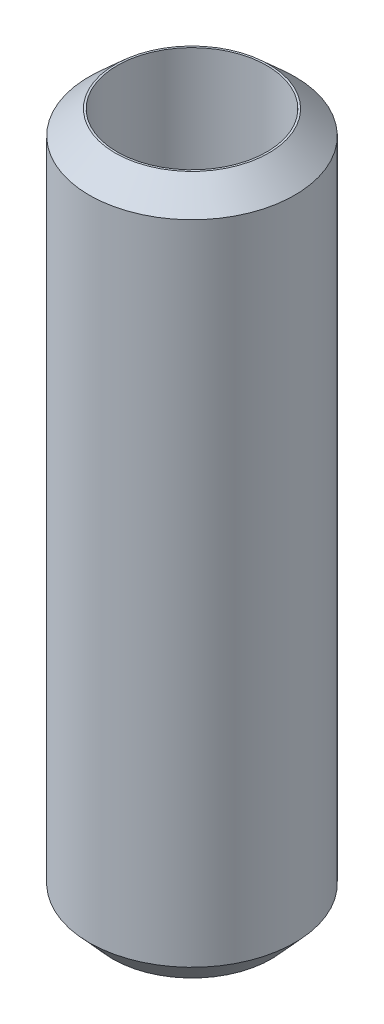
ISO-10303-21;
HEADER;
FILE_DESCRIPTION(('STEP AP214'),'2;1');
FILE_NAME('part.step','',(''),(''),'','','');
FILE_SCHEMA(('AUTOMOTIVE_DESIGN { 1 0 10303 214 1 1 1 1 }'));
ENDSEC;
DATA;
#1=APPLICATION_CONTEXT('core data for automotive mechanical design processes');
#2=APPLICATION_PROTOCOL_DEFINITION('international standard','automotive_design',2000,#1);
#3=PRODUCT_CONTEXT('',#1,'mechanical');
#4=PRODUCT('Part','Part','',(#3));
#5=PRODUCT_RELATED_PRODUCT_CATEGORY('part','',(#4));
#6=PRODUCT_DEFINITION_FORMATION('','',#4);
#7=PRODUCT_DEFINITION_CONTEXT('part definition',#1,'design');
#8=PRODUCT_DEFINITION('design','',#6,#7);
#9=PRODUCT_DEFINITION_SHAPE('','',#8);
#10=(LENGTH_UNIT() NAMED_UNIT(*) SI_UNIT(.MILLI.,.METRE.));
#11=(NAMED_UNIT(*) PLANE_ANGLE_UNIT() SI_UNIT($,.RADIAN.));
#12=(NAMED_UNIT(*) SI_UNIT($,.STERADIAN.) SOLID_ANGLE_UNIT());
#13=UNCERTAINTY_MEASURE_WITH_UNIT(LENGTH_MEASURE(1.E-05),#10,'distance_accuracy_value','');
#14=(GEOMETRIC_REPRESENTATION_CONTEXT(3) GLOBAL_UNCERTAINTY_ASSIGNED_CONTEXT((#13)) GLOBAL_UNIT_ASSIGNED_CONTEXT((#10,
#11,#12)) REPRESENTATION_CONTEXT('',''));
#15=CARTESIAN_POINT('',(0.,0.,0.));
#16=DIRECTION('',(0.,0.,1.));
#17=DIRECTION('',(1.,0.,0.));
#18=AXIS2_PLACEMENT_3D('',#15,#16,#17);
#19=CARTESIAN_POINT('',(0.,169.547093007213,0.));
#20=DIRECTION('',(0.,-1.,0.));
#21=DIRECTION('',(0.,0.,-1.));
#22=AXIS2_PLACEMENT_3D('',#19,#20,#21);
#23=CYLINDRICAL_SURFACE('',#22,25.);
#24=CARTESIAN_POINT('',(0.,163.824932687635,0.));
#25=DIRECTION('',(0.,1.,0.));
#26=DIRECTION('',(0.,0.,1.));
#27=AXIS2_PLACEMENT_3D('',#24,#25,#26);
#28=CIRCLE('',#27,25.);
#29=CARTESIAN_POINT('',(0.,163.824932687635,25.));
#30=VERTEX_POINT('',#29);
#31=EDGE_CURVE('E50',#30,#30,#28,.F.);
#32=ORIENTED_EDGE('',*,*,#31,.T.);
#33=EDGE_LOOP('',(#32));
#34=FACE_BOUND('',#33,.T.);
#35=CARTESIAN_POINT('',(0.,6.31015189124612,0.));
#36=DIRECTION('',(0.,1.,0.));
#37=DIRECTION('',(0.,0.,1.));
#38=AXIS2_PLACEMENT_3D('',#35,#36,#37);
#39=CIRCLE('',#38,25.);
#40=CARTESIAN_POINT('',(0.,6.31015189124612,25.));
#41=VERTEX_POINT('',#40);
#42=EDGE_CURVE('E51',#41,#41,#39,.T.);
#43=ORIENTED_EDGE('',*,*,#42,.T.);
#44=EDGE_LOOP('',(#43));
#45=FACE_BOUND('',#44,.T.);
#46=ADVANCED_FACE('F39',(#34,#45),#23,.T.);
#47=CARTESIAN_POINT('',(0.,169.547093007213,0.));
#48=DIRECTION('',(0.,1.,0.));
#49=DIRECTION('',(0.,0.,1.));
#50=AXIS2_PLACEMENT_3D('',#47,#48,#49);
#51=PLANE('',#50);
#52=CARTESIAN_POINT('',(0.,169.547093007213,0.));
#53=DIRECTION('',(0.,1.,0.));
#54=DIRECTION('',(0.,0.,1.));
#55=AXIS2_PLACEMENT_3D('',#52,#53,#54);
#56=CIRCLE('',#55,18.6898481087538);
#57=CARTESIAN_POINT('',(0.,169.547093007213,18.6898481087538));
#58=VERTEX_POINT('',#57);
#59=EDGE_CURVE('E54',#58,#58,#56,.T.);
#60=ORIENTED_EDGE('',*,*,#59,.T.);
#61=EDGE_LOOP('',(#60));
#62=FACE_BOUND('',#61,.T.);
#63=CARTESIAN_POINT('',(0.,169.547093007213,0.));
#64=DIRECTION('',(0.,1.,0.));
#65=DIRECTION('',(0.,0.,1.));
#66=AXIS2_PLACEMENT_3D('',#63,#64,#65);
#67=CIRCLE('',#66,18.2172366982053);
#68=CARTESIAN_POINT('',(0.,169.547093007213,18.2172366982053));
#69=VERTEX_POINT('',#68);
#70=EDGE_CURVE('E58',#69,#69,#67,.T.);
#71=ORIENTED_EDGE('',*,*,#70,.F.);
#72=EDGE_LOOP('',(#71));
#73=FACE_BOUND('',#72,.T.);
#74=ADVANCED_FACE('F69',(#62,#73),#51,.T.);
#75=CARTESIAN_POINT('',(0.,0.,0.));
#76=DIRECTION('',(0.,1.,0.));
#77=DIRECTION('',(0.,0.,1.));
#78=AXIS2_PLACEMENT_3D('',#75,#76,#77);
#79=PLANE('',#78);
#80=CARTESIAN_POINT('',(0.,0.,0.));
#81=DIRECTION('',(0.,1.,0.));
#82=DIRECTION('',(0.,0.,1.));
#83=AXIS2_PLACEMENT_3D('',#80,#81,#82);
#84=CIRCLE('',#83,19.2778396804223);
#85=CARTESIAN_POINT('',(0.,0.,19.2778396804223));
#86=VERTEX_POINT('',#85);
#87=EDGE_CURVE('E10',#86,#86,#84,.F.);
#88=ORIENTED_EDGE('',*,*,#87,.T.);
#89=EDGE_LOOP('',(#88));
#90=FACE_BOUND('',#89,.T.);
#91=CARTESIAN_POINT('',(0.,0.,0.));
#92=DIRECTION('',(0.,1.,0.));
#93=DIRECTION('',(0.,0.,1.));
#94=AXIS2_PLACEMENT_3D('',#91,#92,#93);
#95=CIRCLE('',#94,18.2172366982053);
#96=CARTESIAN_POINT('',(0.,0.,18.2172366982053));
#97=VERTEX_POINT('',#96);
#98=EDGE_CURVE('E63',#97,#97,#95,.T.);
#99=ORIENTED_EDGE('',*,*,#98,.T.);
#100=EDGE_LOOP('',(#99));
#101=FACE_BOUND('',#100,.T.);
#102=ADVANCED_FACE('F75',(#90,#101),#79,.F.);
#103=CARTESIAN_POINT('',(0.,169.547093007213,0.));
#104=DIRECTION('',(0.,-1.,0.));
#105=DIRECTION('',(0.,0.,-1.));
#106=AXIS2_PLACEMENT_3D('',#103,#104,#105);
#107=CYLINDRICAL_SURFACE('',#106,18.2172366982053);
#108=ORIENTED_EDGE('',*,*,#70,.T.);
#109=EDGE_LOOP('',(#108));
#110=FACE_BOUND('',#109,.T.);
#111=ORIENTED_EDGE('',*,*,#98,.F.);
#112=EDGE_LOOP('',(#111));
#113=FACE_BOUND('',#112,.T.);
#114=ADVANCED_FACE('F70',(#110,#113),#107,.F.);
#115=CARTESIAN_POINT('',(0.,169.547093007213,0.));
#116=DIRECTION('',(0.,-1.,0.));
#117=DIRECTION('',(0.,0.,-1.));
#118=AXIS2_PLACEMENT_3D('',#115,#116,#117);
#119=CONICAL_SURFACE('',#118,18.6898481087538,0.834227031792203);
#120=ORIENTED_EDGE('',*,*,#31,.F.);
#121=EDGE_LOOP('',(#120));
#122=FACE_BOUND('',#121,.T.);
#123=ORIENTED_EDGE('',*,*,#59,.F.);
#124=EDGE_LOOP('',(#123));
#125=FACE_BOUND('',#124,.T.);
#126=ADVANCED_FACE('F81',(#122,#125),#119,.T.);
#127=CARTESIAN_POINT('',(0.,6.31015189124612,0.));
#128=DIRECTION('',(0.,1.,0.));
#129=DIRECTION('',(0.,0.,1.));
#130=AXIS2_PLACEMENT_3D('',#127,#128,#129);
#131=CONICAL_SURFACE('',#130,25.,0.736569295002693);
#132=ORIENTED_EDGE('',*,*,#87,.F.);
#133=EDGE_LOOP('',(#132));
#134=FACE_BOUND('',#133,.T.);
#135=ORIENTED_EDGE('',*,*,#42,.F.);
#136=EDGE_LOOP('',(#135));
#137=FACE_BOUND('',#136,.T.);
#138=ADVANCED_FACE('F45',(#134,#137),#131,.T.);
#139=CLOSED_SHELL('',(#46,#74,#102,#114,#126,#138));
#140=MANIFOLD_SOLID_BREP('B2',#139);
#141=ADVANCED_BREP_SHAPE_REPRESENTATION('',(#18,#140),#14);
#142=SHAPE_DEFINITION_REPRESENTATION(#9,#141);
ENDSEC;
END-ISO-10303-21;
